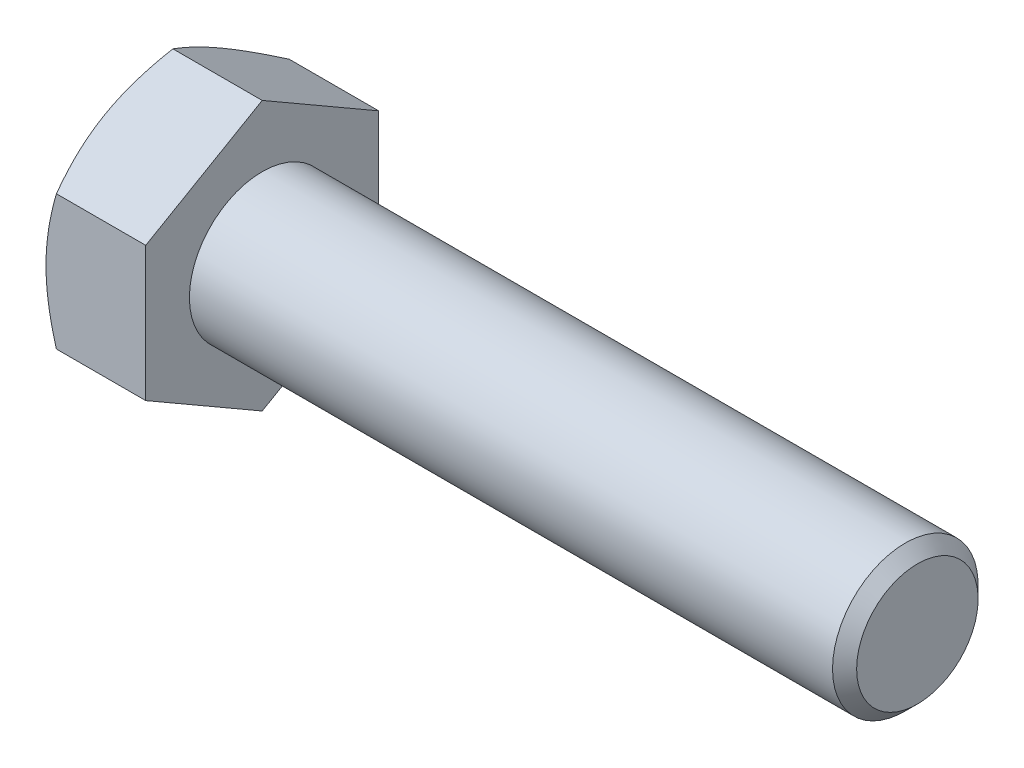
ISO-10303-21;
HEADER;
FILE_DESCRIPTION(('STEP AP214'),'2;1');
FILE_NAME('part.step','',(''),(''),'','','');
FILE_SCHEMA(('AUTOMOTIVE_DESIGN { 1 0 10303 214 1 1 1 1 }'));
ENDSEC;
DATA;
#1=APPLICATION_CONTEXT('core data for automotive mechanical design processes');
#2=APPLICATION_PROTOCOL_DEFINITION('international standard','automotive_design',2000,#1);
#3=PRODUCT_CONTEXT('',#1,'mechanical');
#4=PRODUCT('Part','Part','',(#3));
#5=PRODUCT_RELATED_PRODUCT_CATEGORY('part','',(#4));
#6=PRODUCT_DEFINITION_FORMATION('','',#4);
#7=PRODUCT_DEFINITION_CONTEXT('part definition',#1,'design');
#8=PRODUCT_DEFINITION('design','',#6,#7);
#9=PRODUCT_DEFINITION_SHAPE('','',#8);
#10=(LENGTH_UNIT() NAMED_UNIT(*) SI_UNIT(.MILLI.,.METRE.));
#11=(NAMED_UNIT(*) PLANE_ANGLE_UNIT() SI_UNIT($,.RADIAN.));
#12=(NAMED_UNIT(*) SI_UNIT($,.STERADIAN.) SOLID_ANGLE_UNIT());
#13=UNCERTAINTY_MEASURE_WITH_UNIT(LENGTH_MEASURE(1.E-05),#10,'distance_accuracy_value','');
#14=(GEOMETRIC_REPRESENTATION_CONTEXT(3) GLOBAL_UNCERTAINTY_ASSIGNED_CONTEXT((#13)) GLOBAL_UNIT_ASSIGNED_CONTEXT((#10,
#11,#12)) REPRESENTATION_CONTEXT('',''));
#15=CARTESIAN_POINT('',(0.,0.,0.));
#16=DIRECTION('',(0.,0.,1.));
#17=DIRECTION('',(1.,0.,0.));
#18=AXIS2_PLACEMENT_3D('',#15,#16,#17);
#19=CARTESIAN_POINT('',(6.85,4.618802153517,-8.));
#20=DIRECTION('',(0.,-0.866025403784438,0.500000000000001));
#21=DIRECTION('',(0.,-0.500000000000001,-0.866025403784438));
#22=AXIS2_PLACEMENT_3D('',#19,#20,#21);
#23=PLANE('',#22);
#24=CARTESIAN_POINT('',(0.714597847732979,9.23771977708786,0.0002));
#25=CARTESIAN_POINT('',(0.655990714047303,9.13619343437813,-0.175648783879896));
#26=CARTESIAN_POINT('',(0.600043401047296,9.03428856550538,-0.352153194306135));
#27=CARTESIAN_POINT('',(0.494201005024671,8.82965122633297,-0.70659546287846));
#28=CARTESIAN_POINT('',(0.444308534431071,8.72691841905233,-0.884533904692713));
#29=CARTESIAN_POINT('',(0.304692797206869,8.41707512197076,-1.42119823762264));
#30=CARTESIAN_POINT('',(0.225281170978371,8.20874154247285,-1.78204258223572));
#31=CARTESIAN_POINT('',(0.132161646294491,7.89697436704785,-2.32203917020405));
#32=CARTESIAN_POINT('',(0.105634581029127,7.79447216638295,-2.49957818964329));
#33=CARTESIAN_POINT('',(0.0611531748588782,7.58900421950647,-2.8554591129602));
#34=CARTESIAN_POINT('',(0.0431980765145818,7.4860385150631,-3.03380094449324));
#35=CARTESIAN_POINT('',(0.016315648491866,7.27992981503517,-3.39079168482359));
#36=CARTESIAN_POINT('',(0.00737807354623409,7.17678715432035,-3.5694400136095));
#37=CARTESIAN_POINT('',(-0.00127769603486985,6.97040655051484,-3.92690170509738));
#38=CARTESIAN_POINT('',(-0.000996175497150476,6.86716861046638,-4.10571506253007));
#39=CARTESIAN_POINT('',(0.00814502526877541,6.67416139438127,-4.44001336701691));
#40=CARTESIAN_POINT('',(0.01588960436737,6.58437849849726,-4.59552190433867));
#41=CARTESIAN_POINT('',(0.0382011348534286,6.40502298765178,-4.90617476174051));
#42=CARTESIAN_POINT('',(0.0527685461381473,6.31545038727451,-5.06131905656));
#43=CARTESIAN_POINT('',(0.106360690527535,6.04707935721953,-5.52615131589482));
#44=CARTESIAN_POINT('',(0.155268641669142,5.86875596743374,-5.83501648718172));
#45=CARTESIAN_POINT('',(0.277539403234311,5.51021755801478,-6.4560232287603));
#46=CARTESIAN_POINT('',(0.351420520375997,5.3300482973958,-6.76808554211448));
#47=CARTESIAN_POINT('',(0.519100141254969,4.97239658367398,-7.38755648169476));
#48=CARTESIAN_POINT('',(0.612859260854453,4.79490955046824,-7.69497304089175));
#49=CARTESIAN_POINT('',(0.714597847732973,4.61868668346316,-8.0002));
#50=B_SPLINE_CURVE_WITH_KNOTS('',3,(#24,#25,#26,#27,#28,#29,#30,#31,#32,#33,#34,#35,#36,#37,#38,
#39,#40,#41,#42,#43,#44,#45,#46,#47,#48,#49),.UNSPECIFIED.,.F.,.F.,(4,2,2,2,2,2,2,2,2,2,2,2,4),
(0.,0.633973543721352,1.26821965714356,2.53934712434766,3.15934343977049,3.77928496069784,
4.39852133866766,5.01773858515596,5.55680239410249,6.09590254421148,7.17487077411835,
8.27776850154293,9.37850115249055),.UNSPECIFIED.);
#51=CARTESIAN_POINT('',(0.714531179816327,9.23760430703402,0.));
#52=VERTEX_POINT('',#51);
#53=CARTESIAN_POINT('',(0.,6.92820323027551,-4.00000000000001));
#54=VERTEX_POINT('',#53);
#55=EDGE_CURVE('E48',#52,#54,#50,.T.);
#56=ORIENTED_EDGE('',*,*,#55,.F.);
#57=DIRECTION('',(-1.,0.,0.));
#58=VECTOR('',#57,1.);
#59=CARTESIAN_POINT('',(6.85,9.23760430703402,0.));
#60=LINE('',#59,#58);
#61=CARTESIAN_POINT('',(6.85,9.23760430703402,0.));
#62=VERTEX_POINT('',#61);
#63=EDGE_CURVE('E144',#62,#52,#60,.T.);
#64=ORIENTED_EDGE('',*,*,#63,.F.);
#65=DIRECTION('',(0.,0.500000000000001,0.866025403784438));
#66=VECTOR('',#65,1.);
#67=CARTESIAN_POINT('',(6.85,4.618802153517,-8.));
#68=LINE('',#67,#66);
#69=CARTESIAN_POINT('',(6.85,4.618802153517,-8.));
#70=VERTEX_POINT('',#69);
#71=EDGE_CURVE('E235',#70,#62,#68,.T.);
#72=ORIENTED_EDGE('',*,*,#71,.F.);
#73=DIRECTION('',(-1.,0.,0.));
#74=VECTOR('',#73,1.);
#75=CARTESIAN_POINT('',(6.85,4.618802153517,-8.));
#76=LINE('',#75,#74);
#77=CARTESIAN_POINT('',(0.714531179816322,4.618802153517,-8.));
#78=VERTEX_POINT('',#77);
#79=EDGE_CURVE('E132',#70,#78,#76,.T.);
#80=ORIENTED_EDGE('',*,*,#79,.T.);
#81=EDGE_CURVE('E126',#54,#78,#50,.T.);
#82=ORIENTED_EDGE('',*,*,#81,.F.);
#83=EDGE_LOOP('',(#56,#64,#72,#80,#82));
#84=FACE_BOUND('',#83,.T.);
#85=ADVANCED_FACE('F32',(#84),#23,.F.);
#86=CARTESIAN_POINT('',(6.85,9.23760430703402,0.));
#87=DIRECTION('',(0.,-0.866025403784438,-0.500000000000001));
#88=DIRECTION('',(0.,0.500000000000001,-0.866025403784438));
#89=AXIS2_PLACEMENT_3D('',#86,#87,#88);
#90=PLANE('',#89);
#91=CARTESIAN_POINT('',(0.714597847732972,4.61868668346317,8.0002));
#92=CARTESIAN_POINT('',(0.655990714047297,4.72021302617289,7.8243512161201));
#93=CARTESIAN_POINT('',(0.60004340104729,4.82211789504564,7.64784680569386));
#94=CARTESIAN_POINT('',(0.494201005024666,5.02675523421805,7.29340453712154));
#95=CARTESIAN_POINT('',(0.444308534431066,5.12948804149869,7.11546609530729));
#96=CARTESIAN_POINT('',(0.304692797206865,5.43933133858026,6.57880176237735));
#97=CARTESIAN_POINT('',(0.225281170978369,5.64766491807818,6.21795741776427));
#98=CARTESIAN_POINT('',(0.132161646294489,5.95943209350317,5.67796082979595));
#99=CARTESIAN_POINT('',(0.105634581029124,6.06193429416808,5.50042181035671));
#100=CARTESIAN_POINT('',(0.061153174858875,6.26740224104455,5.1445408870398));
#101=CARTESIAN_POINT('',(0.0431980765145795,6.37036794548792,4.96619905550676));
#102=CARTESIAN_POINT('',(0.0163156484918648,6.57647664551585,4.6092083151764));
#103=CARTESIAN_POINT('',(0.00737807354623311,6.67961930623068,4.4305599863905));
#104=CARTESIAN_POINT('',(-0.00127769603486985,6.88599991003618,4.07309829490262));
#105=CARTESIAN_POINT('',(-0.000996175497149782,6.98923785008464,3.89428493746993));
#106=CARTESIAN_POINT('',(0.00814502526877646,7.18224506616976,3.5599866329831));
#107=CARTESIAN_POINT('',(0.0158896043673708,7.27202796205376,3.40447809566133));
#108=CARTESIAN_POINT('',(0.0382011348534297,7.45138347289924,3.09382523825949));
#109=CARTESIAN_POINT('',(0.0527685461381489,7.54095607327651,2.93868094344));
#110=CARTESIAN_POINT('',(0.106360690527537,7.80932710333149,2.47384868410518));
#111=CARTESIAN_POINT('',(0.155268641669145,7.98765049311728,2.16498351281828));
#112=CARTESIAN_POINT('',(0.277539403234315,8.34618890253625,1.5439767712397));
#113=CARTESIAN_POINT('',(0.351420520376001,8.52635816315522,1.23191445788552));
#114=CARTESIAN_POINT('',(0.519100141254974,8.88400987687705,0.612443518305241));
#115=CARTESIAN_POINT('',(0.612859260854458,9.06149691008278,0.30502695910825));
#116=CARTESIAN_POINT('',(0.714597847732978,9.23771977708786,-0.000200000000000052));
#117=B_SPLINE_CURVE_WITH_KNOTS('',3,(#91,#92,#93,#94,#95,#96,#97,#98,#99,#100,#101,#102,#103,
#104,#105,#106,#107,#108,#109,#110,#111,#112,#113,#114,#115,#116),.UNSPECIFIED.,.F.,.F.,(4,2,2,
2,2,2,2,2,2,2,2,2,4),(0.,0.633973543721351,1.26821965714356,2.53934712434766,3.15934343977049,
3.77928496069784,4.39852133866766,5.01773858515595,5.55680239410249,6.09590254421148,
7.17487077411835,8.27776850154292,9.37850115249054),.UNSPECIFIED.);
#118=CARTESIAN_POINT('',(0.714531179816321,4.61880215351701,8.));
#119=VERTEX_POINT('',#118);
#120=CARTESIAN_POINT('',(0.,6.92820323027551,4.00000000000001));
#121=VERTEX_POINT('',#120);
#122=EDGE_CURVE('E55',#119,#121,#117,.T.);
#123=ORIENTED_EDGE('',*,*,#122,.F.);
#124=DIRECTION('',(-1.,0.,0.));
#125=VECTOR('',#124,1.);
#126=CARTESIAN_POINT('',(6.85,4.61880215351701,8.));
#127=LINE('',#126,#125);
#128=CARTESIAN_POINT('',(6.85,4.61880215351701,8.));
#129=VERTEX_POINT('',#128);
#130=EDGE_CURVE('E142',#129,#119,#127,.T.);
#131=ORIENTED_EDGE('',*,*,#130,.F.);
#132=DIRECTION('',(0.,-0.500000000000001,0.866025403784438));
#133=VECTOR('',#132,1.);
#134=CARTESIAN_POINT('',(6.85,9.23760430703402,0.));
#135=LINE('',#134,#133);
#136=EDGE_CURVE('E233',#62,#129,#135,.T.);
#137=ORIENTED_EDGE('',*,*,#136,.F.);
#138=ORIENTED_EDGE('',*,*,#63,.T.);
#139=EDGE_CURVE('E159',#121,#52,#117,.T.);
#140=ORIENTED_EDGE('',*,*,#139,.F.);
#141=EDGE_LOOP('',(#123,#131,#137,#138,#140));
#142=FACE_BOUND('',#141,.T.);
#143=ADVANCED_FACE('F165',(#142),#90,.F.);
#144=CARTESIAN_POINT('',(6.85,4.61880215351701,8.));
#145=DIRECTION('',(0.,0.,-1.));
#146=DIRECTION('',(0.,1.,0.));
#147=AXIS2_PLACEMENT_3D('',#144,#145,#146);
#148=PLANE('',#147);
#149=CARTESIAN_POINT('',(4.02490591677329,-12.6546855991449,8.));
#150=CARTESIAN_POINT('',(3.85338488067432,-12.3031246943084,8.));
#151=CARTESIAN_POINT('',(3.68343820048659,-11.9507829330126,8.));
#152=CARTESIAN_POINT('',(3.34757428373753,-11.2441233421334,8.));
#153=CARTESIAN_POINT('',(3.1816576368725,-10.8898052325765,8.));
#154=CARTESIAN_POINT('',(2.85395194855879,-10.177068949224,8.));
#155=CARTESIAN_POINT('',(2.69218825446258,-9.81863908249929,8.));
#156=CARTESIAN_POINT('',(2.37495727163404,-9.09901413787099,8.));
#157=CARTESIAN_POINT('',(2.2194897011794,-8.73781918455394,8.));
#158=CARTESIAN_POINT('',(1.911249099453,-7.9995005219669,8.));
#159=CARTESIAN_POINT('',(1.75875676876378,-7.62225899821521,8.));
#160=CARTESIAN_POINT('',(1.46472411543646,-6.86345577325906,8.));
#161=CARTESIAN_POINT('',(1.32318498677801,-6.48189360625492,8.));
#162=CARTESIAN_POINT('',(1.0545943266276,-5.71447512846893,8.));
#163=CARTESIAN_POINT('',(0.92751547743501,-5.32862847865212,8.));
#164=CARTESIAN_POINT('',(0.691757211972646,-4.55141880683297,8.));
#165=CARTESIAN_POINT('',(0.583072255498522,-4.16005748444888,8.));
#166=CARTESIAN_POINT('',(0.389750377059007,-3.37376378378104,8.));
#167=CARTESIAN_POINT('',(0.304973724094147,-2.97886668689221,8.));
#168=CARTESIAN_POINT('',(0.199275200034067,-2.38273452721076,8.));
#169=CARTESIAN_POINT('',(0.16761875545253,-2.18337977546988,8.));
#170=CARTESIAN_POINT('',(0.112075358367336,-1.78359737346042,8.));
#171=CARTESIAN_POINT('',(0.0881876497104334,-1.58316982954114,8.));
#172=CARTESIAN_POINT('',(0.0489706974028728,-1.18423541636501,8.));
#173=CARTESIAN_POINT('',(0.0335291727837681,-0.985739633099688,8.));
#174=CARTESIAN_POINT('',(0.0110629714200266,-0.588272081696571,8.));
#175=CARTESIAN_POINT('',(0.00403814809138546,-0.389300321908781,8.));
#176=CARTESIAN_POINT('',(-0.00142584062308302,0.00876221739739484,8.));
#177=CARTESIAN_POINT('',(0.000134957775689625,0.207852996410198,8.));
#178=CARTESIAN_POINT('',(0.011801422126109,0.605786210981734,8.));
#179=CARTESIAN_POINT('',(0.021907467857363,0.80462863510938,8.));
#180=CARTESIAN_POINT('',(0.0557165381587485,1.27520492278817,8.));
#181=CARTESIAN_POINT('',(0.0830672705335619,1.5466829239484,8.));
#182=CARTESIAN_POINT('',(0.15225923979733,2.08777093274818,8.));
#183=CARTESIAN_POINT('',(0.1941022454765,2.35738070827079,8.));
#184=CARTESIAN_POINT('',(0.339163191030429,3.16301775718138,7.99999999999999));
#185=CARTESIAN_POINT('',(0.461891297316744,3.69558689266571,8.));
#186=CARTESIAN_POINT('',(0.676586598475547,4.49226054421558,8.));
#187=CARTESIAN_POINT('',(0.75430185357481,4.76044513184218,8.));
#188=CARTESIAN_POINT('',(0.918275620129026,5.29421545251859,8.));
#189=CARTESIAN_POINT('',(1.00453419425135,5.55980116648931,8.));
#190=CARTESIAN_POINT('',(1.1841720369208,6.08844838170897,8.));
#191=CARTESIAN_POINT('',(1.27754932022059,6.35151056384124,8.));
#192=CARTESIAN_POINT('',(1.47027925064867,6.87542422157424,8.));
#193=CARTESIAN_POINT('',(1.56963178819541,7.13627573761684,7.99999999999999));
#194=CARTESIAN_POINT('',(1.83061788769923,7.80218876251027,7.99999999999999));
#195=CARTESIAN_POINT('',(1.99585031155407,8.20583801515887,7.99999999999999));
#196=CARTESIAN_POINT('',(2.33560644018457,9.00922091689221,7.99999999999999));
#197=CARTESIAN_POINT('',(2.51013099908301,9.40895420201324,7.99999999999999));
#198=CARTESIAN_POINT('',(2.86641485367069,10.2053302526422,7.99999999999999));
#199=CARTESIAN_POINT('',(3.04817649814071,10.6019719640146,7.99999999999999));
#200=CARTESIAN_POINT('',(3.41731475401143,11.3926098784746,7.99999999999999));
#201=CARTESIAN_POINT('',(3.60469118042223,11.7866061681983,7.99999999999999));
#202=CARTESIAN_POINT('',(3.98417977419137,12.5730081393898,7.99999999999999));
#203=CARTESIAN_POINT('',(4.17629838528329,12.9654107050659,7.99999999999999));
#204=CARTESIAN_POINT('',(4.56413461314098,13.7484335721844,7.99999999999999));
#205=CARTESIAN_POINT('',(4.75985225388509,14.1390538617309,7.99999999999999));
#206=CARTESIAN_POINT('',(5.15417791142117,14.9187387057041,7.99999999999999));
#207=CARTESIAN_POINT('',(5.35278537700422,15.3078035392312,7.99999999999999));
#208=CARTESIAN_POINT('',(5.75241278006942,16.0846929572358,7.99999999999999));
#209=CARTESIAN_POINT('',(5.95343272769671,16.4725175364891,7.99999999999999));
#210=CARTESIAN_POINT('',(6.5202315836378,17.559169962925,7.99999999999999));
#211=CARTESIAN_POINT('',(6.88826669822291,18.2568208048589,7.99999999999999));
#212=CARTESIAN_POINT('',(7.62911646383156,19.6496204545043,7.99999999999999));
#213=CARTESIAN_POINT('',(8.00193136222297,20.3447691303174,7.99999999999999));
#214=CARTESIAN_POINT('',(8.74998840854046,21.7309493550891,7.99999999999999));
#215=CARTESIAN_POINT('',(9.12521930468554,22.4219869802512,7.99999999999999));
#216=CARTESIAN_POINT('',(9.69012626360778,23.4573861860725,7.99999999999999));
#217=CARTESIAN_POINT('',(9.87876537962879,23.8023143286787,7.99999999999999));
#218=CARTESIAN_POINT('',(10.2566598347554,24.4918322089549,7.99999999999999));
#219=CARTESIAN_POINT('',(10.4459151728861,24.836421947159,7.99999999999999));
#220=CARTESIAN_POINT('',(10.6354414476718,25.1808626447394,7.99999999999999));
#221=B_SPLINE_CURVE_WITH_KNOTS('',3,(#149,#150,#151,#152,#153,#154,#155,#156,#157,#158,#159,
#160,#161,#162,#163,#164,#165,#166,#167,#168,#169,#170,#171,#172,#173,#174,#175,#176,#177,#178,
#179,#180,#181,#182,#183,#184,#185,#186,#187,#188,#189,#190,#191,#192,#193,#194,#195,#196,#197,
#198,#199,#200,#201,#202,#203,#204,#205,#206,#207,#208,#209,#210,#211,#212,#213,#214,#215,#216,
#217,#218,#219,#220),.UNSPECIFIED.,.F.,.F.,(4,2,2,2,2,2,2,2,2,2,2,2,2,2,2,2,2,2,2,2,2,2,2,2,2,2,
2,2,2,2,2,2,2,2,2,4),(0.,1.17352534459167,2.34722138373236,3.52689945532928,4.70652468335868,
5.92708318027306,7.14777454017931,8.36612013432257,9.58409810954659,10.7948027291759,
11.40023293749,12.0056041999049,12.6027191320313,13.1998236647426,13.7969256787822,
14.3940542314437,15.2121538551722,16.0303533636327,17.6675489933805,18.5051258944523,
19.3427089398138,20.1800592506709,21.0173942098501,22.3257038658076,23.6341339884584,
24.9429922771238,26.2518074902209,27.5625113934847,28.8732240324075,30.1836898590194,
31.4941611984269,33.8604586198774,36.2268790025321,38.5858914656951,39.7653151283337,
40.9447369260388),.UNSPECIFIED.);
#222=CARTESIAN_POINT('',(0.71453117981632,-4.618802153517,8.));
#223=VERTEX_POINT('',#222);
#224=CARTESIAN_POINT('',(0.,0.,8.));
#225=VERTEX_POINT('',#224);
#226=EDGE_CURVE('E245',#223,#225,#221,.T.);
#227=ORIENTED_EDGE('',*,*,#226,.F.);
#228=DIRECTION('',(-1.,0.,0.));
#229=VECTOR('',#228,1.);
#230=CARTESIAN_POINT('',(6.85,-4.61880215351699,8.));
#231=LINE('',#230,#229);
#232=CARTESIAN_POINT('',(6.85,-4.61880215351699,8.));
#233=VERTEX_POINT('',#232);
#234=EDGE_CURVE('E134',#233,#223,#231,.T.);
#235=ORIENTED_EDGE('',*,*,#234,.F.);
#236=DIRECTION('',(0.,-1.,0.));
#237=VECTOR('',#236,1.);
#238=CARTESIAN_POINT('',(6.85,4.61880215351701,8.));
#239=LINE('',#238,#237);
#240=EDGE_CURVE('E229',#129,#233,#239,.T.);
#241=ORIENTED_EDGE('',*,*,#240,.F.);
#242=ORIENTED_EDGE('',*,*,#130,.T.);
#243=EDGE_CURVE('E183',#225,#119,#221,.T.);
#244=ORIENTED_EDGE('',*,*,#243,.F.);
#245=EDGE_LOOP('',(#227,#235,#241,#242,#244));
#246=FACE_BOUND('',#245,.T.);
#247=ADVANCED_FACE('F251',(#246),#148,.F.);
#248=CARTESIAN_POINT('',(6.85,-9.23760430703401,0.));
#249=DIRECTION('',(0.,0.866025403784438,-0.500000000000001));
#250=DIRECTION('',(0.,0.500000000000001,0.866025403784438));
#251=AXIS2_PLACEMENT_3D('',#248,#249,#250);
#252=PLANE('',#251);
#253=CARTESIAN_POINT('',(0.714597847732975,-9.23771977708785,-0.000199999999999246));
#254=CARTESIAN_POINT('',(0.655990714047299,-9.13619343437813,0.175648783879897));
#255=CARTESIAN_POINT('',(0.600043401047291,-9.03428856550538,0.352153194306135));
#256=CARTESIAN_POINT('',(0.494201005024666,-8.82965122633296,0.70659546287846));
#257=CARTESIAN_POINT('',(0.444308534431066,-8.72691841905232,0.884533904692713));
#258=CARTESIAN_POINT('',(0.304692797206865,-8.41707512197076,1.42119823762264));
#259=CARTESIAN_POINT('',(0.225281170978367,-8.20874154247284,1.78204258223572));
#260=CARTESIAN_POINT('',(0.132161646294487,-7.89697436704785,2.32203917020405));
#261=CARTESIAN_POINT('',(0.105634581029122,-7.79447216638294,2.49957818964329));
#262=CARTESIAN_POINT('',(0.0611531748588733,-7.58900421950647,2.8554591129602));
#263=CARTESIAN_POINT('',(0.0431980765145776,-7.4860385150631,3.03380094449324));
#264=CARTESIAN_POINT('',(0.0163156484918625,-7.27992981503516,3.39079168482359));
#265=CARTESIAN_POINT('',(0.00737807354623049,-7.17678715432034,3.5694400136095));
#266=CARTESIAN_POINT('',(-0.00127769603487299,-6.97040655051483,3.92690170509738));
#267=CARTESIAN_POINT('',(-0.000996175497153157,-6.86716861046637,4.10571506253007));
#268=CARTESIAN_POINT('',(0.00814502526877215,-6.67416139438126,4.4400133670169));
#269=CARTESIAN_POINT('',(0.0158896043673659,-6.58437849849725,4.59552190433867));
#270=CARTESIAN_POINT('',(0.0382011348534244,-6.40502298765177,4.90617476174051));
#271=CARTESIAN_POINT('',(0.0527685461381437,-6.31545038727451,5.06131905656));
#272=CARTESIAN_POINT('',(0.106360690527532,-6.04707935721953,5.52615131589482));
#273=CARTESIAN_POINT('',(0.15526864166914,-5.86875596743374,5.83501648718172));
#274=CARTESIAN_POINT('',(0.277539403234309,-5.51021755801477,6.4560232287603));
#275=CARTESIAN_POINT('',(0.351420520375994,-5.3300482973958,6.76808554211448));
#276=CARTESIAN_POINT('',(0.519100141254967,-4.97239658367397,7.38755648169476));
#277=CARTESIAN_POINT('',(0.612859260854451,-4.79490955046824,7.69497304089175));
#278=CARTESIAN_POINT('',(0.714597847732972,-4.61868668346316,8.0002));
#279=B_SPLINE_CURVE_WITH_KNOTS('',3,(#253,#254,#255,#256,#257,#258,#259,#260,#261,#262,#263,
#264,#265,#266,#267,#268,#269,#270,#271,#272,#273,#274,#275,#276,#277,#278),.UNSPECIFIED.,.F.,
.F.,(4,2,2,2,2,2,2,2,2,2,2,2,4),(0.,0.633973543721351,1.26821965714356,2.53934712434766,
3.15934343977049,3.77928496069784,4.39852133866766,5.01773858515595,5.55680239410249,
6.09590254421148,7.17487077411835,8.27776850154293,9.37850115249055),.UNSPECIFIED.);
#280=CARTESIAN_POINT('',(0.714531179816323,-9.23760430703401,0.));
#281=VERTEX_POINT('',#280);
#282=CARTESIAN_POINT('',(0.,-6.9282032302755,4.00000000000001));
#283=VERTEX_POINT('',#282);
#284=EDGE_CURVE('E167',#281,#283,#279,.T.);
#285=ORIENTED_EDGE('',*,*,#284,.F.);
#286=DIRECTION('',(-1.,0.,0.));
#287=VECTOR('',#286,1.);
#288=CARTESIAN_POINT('',(6.85,-9.23760430703401,0.));
#289=LINE('',#288,#287);
#290=CARTESIAN_POINT('',(6.85,-9.23760430703401,0.));
#291=VERTEX_POINT('',#290);
#292=EDGE_CURVE('E131',#291,#281,#289,.T.);
#293=ORIENTED_EDGE('',*,*,#292,.F.);
#294=DIRECTION('',(0.,-0.500000000000001,-0.866025403784438));
#295=VECTOR('',#294,1.);
#296=CARTESIAN_POINT('',(6.85,-9.23760430703401,0.));
#297=LINE('',#296,#295);
#298=EDGE_CURVE('E227',#233,#291,#297,.T.);
#299=ORIENTED_EDGE('',*,*,#298,.F.);
#300=ORIENTED_EDGE('',*,*,#234,.T.);
#301=EDGE_CURVE('E169',#283,#223,#279,.T.);
#302=ORIENTED_EDGE('',*,*,#301,.F.);
#303=EDGE_LOOP('',(#285,#293,#299,#300,#302));
#304=FACE_BOUND('',#303,.T.);
#305=ADVANCED_FACE('F223',(#304),#252,.F.);
#306=CARTESIAN_POINT('',(6.85,-4.61880215351701,-8.));
#307=DIRECTION('',(0.,0.866025403784439,0.5));
#308=DIRECTION('',(0.,-0.5,0.866025403784439));
#309=AXIS2_PLACEMENT_3D('',#306,#307,#308);
#310=PLANE('',#309);
#311=CARTESIAN_POINT('',(0.714597847732976,-4.61868668346317,-8.0002));
#312=CARTESIAN_POINT('',(0.6559907140473,-4.7202130261729,-7.82435121612011));
#313=CARTESIAN_POINT('',(0.600043401047293,-4.82211789504564,-7.64784680569387));
#314=CARTESIAN_POINT('',(0.494201005024669,-5.02675523421806,-7.29340453712154));
#315=CARTESIAN_POINT('',(0.444308534431069,-5.1294880414987,-7.11546609530729));
#316=CARTESIAN_POINT('',(0.304692797206868,-5.43933133858027,-6.57880176237736));
#317=CARTESIAN_POINT('',(0.22528117097837,-5.64766491807818,-6.21795741776428));
#318=CARTESIAN_POINT('',(0.13216164629449,-5.95943209350317,-5.67796082979595));
#319=CARTESIAN_POINT('',(0.105634581029125,-6.06193429416808,-5.50042181035672));
#320=CARTESIAN_POINT('',(0.061153174858877,-6.26740224104455,-5.1445408870398));
#321=CARTESIAN_POINT('',(0.0431980765145813,-6.37036794548792,-4.96619905550676));
#322=CARTESIAN_POINT('',(0.0163156484918663,-6.57647664551586,-4.60920831517641));
#323=CARTESIAN_POINT('',(0.00737807354623424,-6.67961930623068,-4.4305599863905));
#324=CARTESIAN_POINT('',(-0.00127769603486924,-6.88599991003618,-4.07309829490262));
#325=CARTESIAN_POINT('',(-0.000996175497149314,-6.98923785008464,-3.89428493746993));
#326=CARTESIAN_POINT('',(0.00814502526877628,-7.18224506616976,-3.55998663298309));
#327=CARTESIAN_POINT('',(0.0158896043673702,-7.27202796205376,-3.40447809566133));
#328=CARTESIAN_POINT('',(0.0382011348534287,-7.45138347289924,-3.09382523825949));
#329=CARTESIAN_POINT('',(0.052768546138148,-7.54095607327651,-2.93868094344));
#330=CARTESIAN_POINT('',(0.106360690527536,-7.80932710333149,-2.47384868410518));
#331=CARTESIAN_POINT('',(0.155268641669144,-7.98765049311728,-2.16498351281828));
#332=CARTESIAN_POINT('',(0.277539403234313,-8.34618890253624,-1.5439767712397));
#333=CARTESIAN_POINT('',(0.351420520375998,-8.52635816315522,-1.23191445788552));
#334=CARTESIAN_POINT('',(0.519100141254971,-8.88400987687704,-0.61244351830524));
#335=CARTESIAN_POINT('',(0.612859260854454,-9.06149691008277,-0.305026959108249));
#336=CARTESIAN_POINT('',(0.714597847732974,-9.23771977708785,0.00020000000000093));
#337=B_SPLINE_CURVE_WITH_KNOTS('',3,(#311,#312,#313,#314,#315,#316,#317,#318,#319,#320,#321,
#322,#323,#324,#325,#326,#327,#328,#329,#330,#331,#332,#333,#334,#335,#336),.UNSPECIFIED.,.F.,
.F.,(4,2,2,2,2,2,2,2,2,2,2,2,4),(0.,0.633973543721351,1.26821965714356,2.53934712434766,
3.15934343977049,3.77928496069784,4.39852133866766,5.01773858515595,5.55680239410249,
6.09590254421148,7.17487077411835,8.27776850154293,9.37850115249054),.UNSPECIFIED.);
#338=CARTESIAN_POINT('',(0.714531179816161,-4.61880215351726,-8.));
#339=VERTEX_POINT('',#338);
#340=CARTESIAN_POINT('',(0.,-6.92820323027551,-4.));
#341=VERTEX_POINT('',#340);
#342=EDGE_CURVE('E108',#339,#341,#337,.T.);
#343=ORIENTED_EDGE('',*,*,#342,.F.);
#344=DIRECTION('',(-1.,0.,0.));
#345=VECTOR('',#344,1.);
#346=CARTESIAN_POINT('',(6.85,-4.61880215351701,-8.));
#347=LINE('',#346,#345);
#348=CARTESIAN_POINT('',(6.85,-4.61880215351701,-8.));
#349=VERTEX_POINT('',#348);
#350=EDGE_CURVE('E122',#349,#339,#347,.T.);
#351=ORIENTED_EDGE('',*,*,#350,.F.);
#352=DIRECTION('',(0.,0.5,-0.866025403784439));
#353=VECTOR('',#352,1.);
#354=CARTESIAN_POINT('',(6.85,-4.61880215351701,-8.));
#355=LINE('',#354,#353);
#356=EDGE_CURVE('E225',#291,#349,#355,.T.);
#357=ORIENTED_EDGE('',*,*,#356,.F.);
#358=ORIENTED_EDGE('',*,*,#292,.T.);
#359=EDGE_CURVE('E125',#341,#281,#337,.T.);
#360=ORIENTED_EDGE('',*,*,#359,.F.);
#361=EDGE_LOOP('',(#343,#351,#357,#358,#360));
#362=FACE_BOUND('',#361,.T.);
#363=ADVANCED_FACE('F120',(#362),#310,.F.);
#364=CARTESIAN_POINT('',(6.85,4.618802153517,-8.));
#365=DIRECTION('',(0.,0.,1.));
#366=DIRECTION('',(0.,-1.,0.));
#367=AXIS2_PLACEMENT_3D('',#364,#365,#366);
#368=PLANE('',#367);
#369=CARTESIAN_POINT('',(4.0249059167733,-12.6546855991449,-8.));
#370=CARTESIAN_POINT('',(3.85338488067433,-12.3031246943084,-8.));
#371=CARTESIAN_POINT('',(3.6834382004866,-11.9507829330126,-8.));
#372=CARTESIAN_POINT('',(3.34757428373754,-11.2441233421334,-8.));
#373=CARTESIAN_POINT('',(3.18165763687251,-10.8898052325765,-8.));
#374=CARTESIAN_POINT('',(2.8539519485588,-10.177068949224,-8.));
#375=CARTESIAN_POINT('',(2.69218825446259,-9.81863908249931,-8.));
#376=CARTESIAN_POINT('',(2.37495727163404,-9.09901413787101,-8.));
#377=CARTESIAN_POINT('',(2.21948970117941,-8.73781918455396,-8.));
#378=CARTESIAN_POINT('',(1.911249099453,-7.99950052196692,-8.));
#379=CARTESIAN_POINT('',(1.75875676876378,-7.62225899821522,-8.));
#380=CARTESIAN_POINT('',(1.46472411543646,-6.86345577325907,-8.));
#381=CARTESIAN_POINT('',(1.32318498677801,-6.48189360625493,-8.));
#382=CARTESIAN_POINT('',(1.0545943266276,-5.71447512846895,-8.));
#383=CARTESIAN_POINT('',(0.927515477435015,-5.32862847865213,-8.));
#384=CARTESIAN_POINT('',(0.691757211972651,-4.55141880683298,-8.));
#385=CARTESIAN_POINT('',(0.583072255498526,-4.16005748444889,-8.));
#386=CARTESIAN_POINT('',(0.389750377059011,-3.37376378378106,-8.));
#387=CARTESIAN_POINT('',(0.30497372409415,-2.97886668689222,-8.));
#388=CARTESIAN_POINT('',(0.19927520003407,-2.38273452721077,-8.));
#389=CARTESIAN_POINT('',(0.167618755452533,-2.18337977546989,-8.));
#390=CARTESIAN_POINT('',(0.112075358367339,-1.78359737346043,-8.));
#391=CARTESIAN_POINT('',(0.0881876497104362,-1.58316982954115,-8.));
#392=CARTESIAN_POINT('',(0.0489706974028747,-1.18423541636502,-8.));
#393=CARTESIAN_POINT('',(0.0335291727837695,-0.9857396330997,-8.));
#394=CARTESIAN_POINT('',(0.011062971420028,-0.588272081696583,-8.));
#395=CARTESIAN_POINT('',(0.00403814809138715,-0.389300321908792,-8.));
#396=CARTESIAN_POINT('',(-0.00142584062308176,0.00876221739738346,-8.));
#397=CARTESIAN_POINT('',(0.00013495777569016,0.207852996410186,-8.));
#398=CARTESIAN_POINT('',(0.0118014221261096,0.605786210981724,-8.));
#399=CARTESIAN_POINT('',(0.0219074678573644,0.80462863510937,-8.));
#400=CARTESIAN_POINT('',(0.0557165381587504,1.27520492278816,-8.));
#401=CARTESIAN_POINT('',(0.083067270533563,1.54668292394839,-8.));
#402=CARTESIAN_POINT('',(0.15225923979733,2.08777093274817,-8.));
#403=CARTESIAN_POINT('',(0.1941022454765,2.35738070827078,-8.));
#404=CARTESIAN_POINT('',(0.339163191030429,3.16301775718137,-8.));
#405=CARTESIAN_POINT('',(0.461891297316744,3.6955868926657,-8.));
#406=CARTESIAN_POINT('',(0.676586598475547,4.49226054421557,-8.));
#407=CARTESIAN_POINT('',(0.754301853574809,4.76044513184217,-8.));
#408=CARTESIAN_POINT('',(0.918275620129025,5.29421545251858,-8.));
#409=CARTESIAN_POINT('',(1.00453419425135,5.5598011664893,-8.));
#410=CARTESIAN_POINT('',(1.18417203692079,6.08844838170895,-8.));
#411=CARTESIAN_POINT('',(1.27754932022058,6.35151056384122,-8.));
#412=CARTESIAN_POINT('',(1.47027925064866,6.87542422157422,-8.));
#413=CARTESIAN_POINT('',(1.56963178819541,7.13627573761683,-8.));
#414=CARTESIAN_POINT('',(1.83061788769923,7.80218876251026,-8.));
#415=CARTESIAN_POINT('',(1.99585031155407,8.20583801515886,-8.));
#416=CARTESIAN_POINT('',(2.33560644018457,9.0092209168922,-8.));
#417=CARTESIAN_POINT('',(2.510130999083,9.40895420201323,-8.));
#418=CARTESIAN_POINT('',(2.86641485367069,10.2053302526422,-8.));
#419=CARTESIAN_POINT('',(3.04817649814071,10.6019719640146,-8.));
#420=CARTESIAN_POINT('',(3.41731475401143,11.3926098784745,-8.));
#421=CARTESIAN_POINT('',(3.60469118042222,11.7866061681983,-8.));
#422=CARTESIAN_POINT('',(3.98417977419137,12.5730081393898,-8.));
#423=CARTESIAN_POINT('',(4.17629838528329,12.9654107050659,-8.));
#424=CARTESIAN_POINT('',(4.56413461314098,13.7484335721844,-8.));
#425=CARTESIAN_POINT('',(4.75985225388508,14.1390538617308,-8.));
#426=CARTESIAN_POINT('',(5.15417791142117,14.9187387057041,-8.));
#427=CARTESIAN_POINT('',(5.35278537700422,15.3078035392312,-8.));
#428=CARTESIAN_POINT('',(5.75241278006942,16.0846929572358,-8.));
#429=CARTESIAN_POINT('',(5.95343272769671,16.4725175364891,-8.));
#430=CARTESIAN_POINT('',(6.5202315836378,17.559169962925,-8.));
#431=CARTESIAN_POINT('',(6.88826669822291,18.2568208048589,-8.));
#432=CARTESIAN_POINT('',(7.62911646383156,19.6496204545043,-8.));
#433=CARTESIAN_POINT('',(8.00193136222298,20.3447691303174,-8.));
#434=CARTESIAN_POINT('',(8.74998840854047,21.7309493550891,-8.));
#435=CARTESIAN_POINT('',(9.12521930468555,22.4219869802512,-8.));
#436=CARTESIAN_POINT('',(9.69012626360779,23.4573861860725,-8.));
#437=CARTESIAN_POINT('',(9.8787653796288,23.8023143286788,-8.));
#438=CARTESIAN_POINT('',(10.2566598347554,24.4918322089549,-8.));
#439=CARTESIAN_POINT('',(10.4459151728861,24.836421947159,-8.));
#440=CARTESIAN_POINT('',(10.6354414476718,25.1808626447394,-8.));
#441=B_SPLINE_CURVE_WITH_KNOTS('',3,(#369,#370,#371,#372,#373,#374,#375,#376,#377,#378,#379,
#380,#381,#382,#383,#384,#385,#386,#387,#388,#389,#390,#391,#392,#393,#394,#395,#396,#397,#398,
#399,#400,#401,#402,#403,#404,#405,#406,#407,#408,#409,#410,#411,#412,#413,#414,#415,#416,#417,
#418,#419,#420,#421,#422,#423,#424,#425,#426,#427,#428,#429,#430,#431,#432,#433,#434,#435,#436,
#437,#438,#439,#440),.UNSPECIFIED.,.F.,.F.,(4,2,2,2,2,2,2,2,2,2,2,2,2,2,2,2,2,2,2,2,2,2,2,2,2,2,
2,2,2,2,2,2,2,2,2,4),(0.,1.17352534459167,2.34722138373237,3.52689945532929,4.70652468335869,
5.92708318027307,7.14777454017933,8.36612013432258,9.58409810954661,10.794802729176,
11.40023293749,12.005604199905,12.6027191320313,13.1998236647426,13.7969256787822,
14.3940542314437,15.2121538551722,16.0303533636327,17.6675489933806,18.5051258944523,
19.3427089398139,20.180059250671,21.0173942098501,22.3257038658076,23.6341339884584,
24.9429922771239,26.2518074902209,27.5625113934848,28.8732240324075,30.1836898590194,
31.4941611984269,33.8604586198774,36.2268790025322,38.5858914656951,39.7653151283338,
40.9447369260388),.UNSPECIFIED.);
#442=CARTESIAN_POINT('',(0.,0.,-8.));
#443=VERTEX_POINT('',#442);
#444=EDGE_CURVE('E114',#78,#443,#441,.F.);
#445=ORIENTED_EDGE('',*,*,#444,.F.);
#446=ORIENTED_EDGE('',*,*,#79,.F.);
#447=DIRECTION('',(0.,1.,0.));
#448=VECTOR('',#447,1.);
#449=CARTESIAN_POINT('',(6.85,4.618802153517,-8.));
#450=LINE('',#449,#448);
#451=EDGE_CURVE('E130',#349,#70,#450,.T.);
#452=ORIENTED_EDGE('',*,*,#451,.F.);
#453=ORIENTED_EDGE('',*,*,#350,.T.);
#454=EDGE_CURVE('E105',#443,#339,#441,.F.);
#455=ORIENTED_EDGE('',*,*,#454,.F.);
#456=EDGE_LOOP('',(#445,#446,#452,#453,#455));
#457=FACE_BOUND('',#456,.T.);
#458=ADVANCED_FACE('F128',(#457),#368,.F.);
#459=CARTESIAN_POINT('',(6.85,9.23760430703402,0.));
#460=DIRECTION('',(1.,0.,0.));
#461=DIRECTION('',(0.,0.,-1.));
#462=AXIS2_PLACEMENT_3D('',#459,#460,#461);
#463=PLANE('',#462);
#464=CARTESIAN_POINT('',(6.85,0.,0.));
#465=DIRECTION('',(1.,0.,0.));
#466=DIRECTION('',(0.,0.,-1.));
#467=AXIS2_PLACEMENT_3D('',#464,#465,#466);
#468=CIRCLE('',#467,5.);
#469=CARTESIAN_POINT('',(6.85,0.,-5.));
#470=VERTEX_POINT('',#469);
#471=EDGE_CURVE('E238',#470,#470,#468,.F.);
#472=ORIENTED_EDGE('',*,*,#471,.T.);
#473=EDGE_LOOP('',(#472));
#474=FACE_BOUND('',#473,.T.);
#475=ORIENTED_EDGE('',*,*,#71,.T.);
#476=ORIENTED_EDGE('',*,*,#136,.T.);
#477=ORIENTED_EDGE('',*,*,#240,.T.);
#478=ORIENTED_EDGE('',*,*,#298,.T.);
#479=ORIENTED_EDGE('',*,*,#356,.T.);
#480=ORIENTED_EDGE('',*,*,#451,.T.);
#481=EDGE_LOOP('',(#475,#476,#477,#478,#479,#480));
#482=FACE_BOUND('',#481,.T.);
#483=ADVANCED_FACE('F253',(#474,#482),#463,.T.);
#484=CARTESIAN_POINT('',(0.,0.,0.));
#485=DIRECTION('',(-1.,0.,0.));
#486=DIRECTION('',(0.,0.,1.));
#487=AXIS2_PLACEMENT_3D('',#484,#485,#486);
#488=CYLINDRICAL_SURFACE('',#487,5.);
#489=ORIENTED_EDGE('',*,*,#471,.F.);
#490=EDGE_LOOP('',(#489));
#491=FACE_BOUND('',#490,.T.);
#492=CARTESIAN_POINT('',(51.022,0.,0.));
#493=DIRECTION('',(-1.,0.,0.));
#494=DIRECTION('',(0.,0.,1.));
#495=AXIS2_PLACEMENT_3D('',#492,#493,#494);
#496=CIRCLE('',#495,5.);
#497=CARTESIAN_POINT('',(51.022,0.,5.));
#498=VERTEX_POINT('',#497);
#499=EDGE_CURVE('E241',#498,#498,#496,.T.);
#500=ORIENTED_EDGE('',*,*,#499,.T.);
#501=EDGE_LOOP('',(#500));
#502=FACE_BOUND('',#501,.T.);
#503=ADVANCED_FACE('F284',(#491,#502),#488,.T.);
#504=CARTESIAN_POINT('',(51.85,0.,0.));
#505=DIRECTION('',(-1.,0.,0.));
#506=DIRECTION('',(0.,0.,1.));
#507=AXIS2_PLACEMENT_3D('',#504,#505,#506);
#508=CONICAL_SURFACE('',#507,4.172,0.785398163397434);
#509=ORIENTED_EDGE('',*,*,#499,.F.);
#510=EDGE_LOOP('',(#509));
#511=FACE_BOUND('',#510,.T.);
#512=CARTESIAN_POINT('',(51.85,0.,0.));
#513=DIRECTION('',(-1.,0.,0.));
#514=DIRECTION('',(0.,0.,1.));
#515=AXIS2_PLACEMENT_3D('',#512,#513,#514);
#516=CIRCLE('',#515,4.172);
#517=CARTESIAN_POINT('',(51.85,0.,4.172));
#518=VERTEX_POINT('',#517);
#519=EDGE_CURVE('E243',#518,#518,#516,.T.);
#520=ORIENTED_EDGE('',*,*,#519,.T.);
#521=EDGE_LOOP('',(#520));
#522=FACE_BOUND('',#521,.T.);
#523=ADVANCED_FACE('F287',(#511,#522),#508,.T.);
#524=CARTESIAN_POINT('',(51.85,0.,0.));
#525=DIRECTION('',(-1.,0.,0.));
#526=DIRECTION('',(0.,0.,1.));
#527=AXIS2_PLACEMENT_3D('',#524,#525,#526);
#528=PLANE('',#527);
#529=ORIENTED_EDGE('',*,*,#519,.F.);
#530=EDGE_LOOP('',(#529));
#531=FACE_BOUND('',#530,.T.);
#532=ADVANCED_FACE('F197',(#531),#528,.F.);
#533=CARTESIAN_POINT('',(0.,0.,0.));
#534=DIRECTION('',(1.,0.,0.));
#535=DIRECTION('',(0.,0.,-1.));
#536=AXIS2_PLACEMENT_3D('',#533,#534,#535);
#537=CONICAL_SURFACE('',#536,8.,1.0471975511966);
#538=ORIENTED_EDGE('',*,*,#342,.T.);
#539=CARTESIAN_POINT('',(0.,0.,0.));
#540=DIRECTION('',(1.,0.,0.));
#541=DIRECTION('',(0.,0.,-1.));
#542=AXIS2_PLACEMENT_3D('',#539,#540,#541);
#543=CIRCLE('',#542,8.);
#544=EDGE_CURVE('E36',#341,#443,#543,.T.);
#545=ORIENTED_EDGE('',*,*,#544,.T.);
#546=ORIENTED_EDGE('',*,*,#454,.T.);
#547=EDGE_LOOP('',(#538,#545,#546));
#548=FACE_BOUND('',#547,.T.);
#549=ADVANCED_FACE('F107',(#548),#537,.T.);
#550=ORIENTED_EDGE('',*,*,#284,.T.);
#551=EDGE_CURVE('E149',#283,#341,#543,.T.);
#552=ORIENTED_EDGE('',*,*,#551,.T.);
#553=ORIENTED_EDGE('',*,*,#359,.T.);
#554=EDGE_LOOP('',(#550,#552,#553));
#555=FACE_BOUND('',#554,.T.);
#556=ADVANCED_FACE('F196',(#555),#537,.T.);
#557=ORIENTED_EDGE('',*,*,#226,.T.);
#558=EDGE_CURVE('E150',#225,#283,#543,.T.);
#559=ORIENTED_EDGE('',*,*,#558,.T.);
#560=ORIENTED_EDGE('',*,*,#301,.T.);
#561=EDGE_LOOP('',(#557,#559,#560));
#562=FACE_BOUND('',#561,.T.);
#563=ADVANCED_FACE('F191',(#562),#537,.T.);
#564=ORIENTED_EDGE('',*,*,#243,.T.);
#565=ORIENTED_EDGE('',*,*,#122,.T.);
#566=CARTESIAN_POINT('',(0.,0.,0.));
#567=DIRECTION('',(-1.,0.,0.));
#568=DIRECTION('',(0.,0.,1.));
#569=AXIS2_PLACEMENT_3D('',#566,#567,#568);
#570=CIRCLE('',#569,8.);
#571=EDGE_CURVE('E115',#225,#121,#570,.T.);
#572=ORIENTED_EDGE('',*,*,#571,.F.);
#573=EDGE_LOOP('',(#564,#565,#572));
#574=FACE_BOUND('',#573,.T.);
#575=ADVANCED_FACE('F195',(#574),#537,.T.);
#576=ORIENTED_EDGE('',*,*,#139,.T.);
#577=ORIENTED_EDGE('',*,*,#55,.T.);
#578=EDGE_CURVE('E41',#54,#121,#543,.T.);
#579=ORIENTED_EDGE('',*,*,#578,.T.);
#580=EDGE_LOOP('',(#576,#577,#579));
#581=FACE_BOUND('',#580,.T.);
#582=ADVANCED_FACE('F158',(#581),#537,.T.);
#583=ORIENTED_EDGE('',*,*,#81,.T.);
#584=ORIENTED_EDGE('',*,*,#444,.T.);
#585=EDGE_CURVE('E11',#443,#54,#543,.T.);
#586=ORIENTED_EDGE('',*,*,#585,.T.);
#587=EDGE_LOOP('',(#583,#584,#586));
#588=FACE_BOUND('',#587,.T.);
#589=ADVANCED_FACE('F256',(#588),#537,.T.);
#590=CARTESIAN_POINT('',(0.,9.23760430703402,0.));
#591=DIRECTION('',(1.,0.,0.));
#592=DIRECTION('',(0.,0.,-1.));
#593=AXIS2_PLACEMENT_3D('',#590,#591,#592);
#594=PLANE('',#593);
#595=ORIENTED_EDGE('',*,*,#585,.F.);
#596=ORIENTED_EDGE('',*,*,#544,.F.);
#597=ORIENTED_EDGE('',*,*,#551,.F.);
#598=ORIENTED_EDGE('',*,*,#558,.F.);
#599=ORIENTED_EDGE('',*,*,#571,.T.);
#600=ORIENTED_EDGE('',*,*,#578,.F.);
#601=EDGE_LOOP('',(#595,#596,#597,#598,#599,#600));
#602=FACE_BOUND('',#601,.T.);
#603=ADVANCED_FACE('F162',(#602),#594,.F.);
#604=CLOSED_SHELL('',(#85,#143,#247,#305,#363,#458,#483,#503,#523,#532,#549,#556,#563,#575,#582,
#589,#603));
#605=MANIFOLD_SOLID_BREP('B2',#604);
#606=ADVANCED_BREP_SHAPE_REPRESENTATION('',(#18,#605),#14);
#607=SHAPE_DEFINITION_REPRESENTATION(#9,#606);
ENDSEC;
END-ISO-10303-21;
